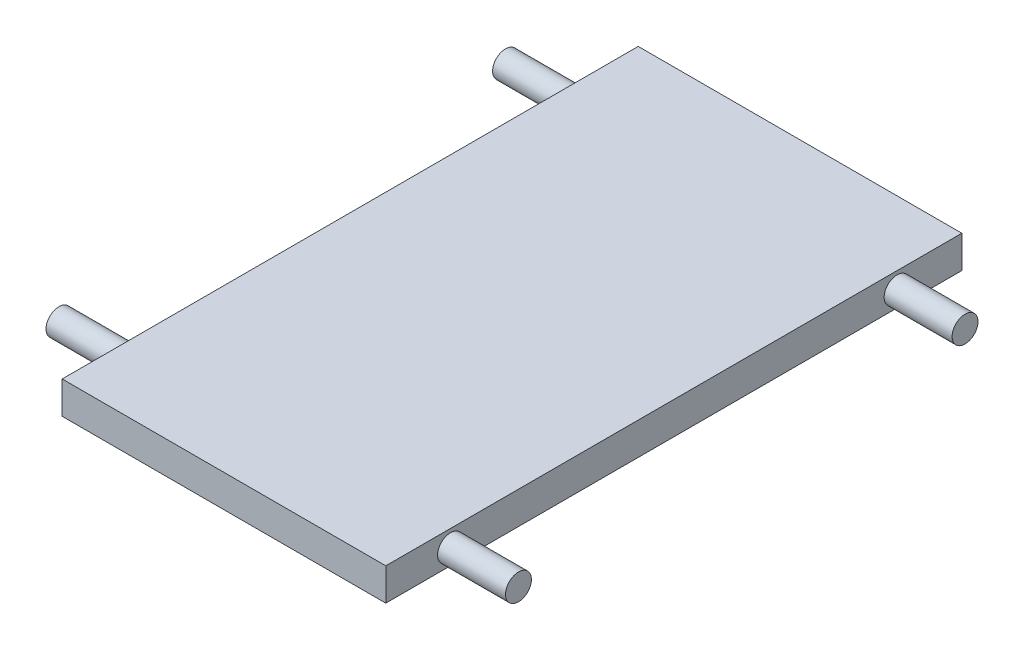
ISO-10303-21;
HEADER;
FILE_DESCRIPTION(('STEP AP214'),'2;1');
FILE_NAME('part.step','',(''),(''),'','','');
FILE_SCHEMA(('AUTOMOTIVE_DESIGN { 1 0 10303 214 1 1 1 1 }'));
ENDSEC;
DATA;
#1=APPLICATION_CONTEXT('core data for automotive mechanical design processes');
#2=APPLICATION_PROTOCOL_DEFINITION('international standard','automotive_design',2000,#1);
#3=PRODUCT_CONTEXT('',#1,'mechanical');
#4=PRODUCT('Part','Part','',(#3));
#5=PRODUCT_RELATED_PRODUCT_CATEGORY('part','',(#4));
#6=PRODUCT_DEFINITION_FORMATION('','',#4);
#7=PRODUCT_DEFINITION_CONTEXT('part definition',#1,'design');
#8=PRODUCT_DEFINITION('design','',#6,#7);
#9=PRODUCT_DEFINITION_SHAPE('','',#8);
#10=(LENGTH_UNIT() NAMED_UNIT(*) SI_UNIT(.MILLI.,.METRE.));
#11=(NAMED_UNIT(*) PLANE_ANGLE_UNIT() SI_UNIT($,.RADIAN.));
#12=(NAMED_UNIT(*) SI_UNIT($,.STERADIAN.) SOLID_ANGLE_UNIT());
#13=UNCERTAINTY_MEASURE_WITH_UNIT(LENGTH_MEASURE(1.E-05),#10,'distance_accuracy_value','');
#14=(GEOMETRIC_REPRESENTATION_CONTEXT(3) GLOBAL_UNCERTAINTY_ASSIGNED_CONTEXT((#13)) GLOBAL_UNIT_ASSIGNED_CONTEXT((#10,
#11,#12)) REPRESENTATION_CONTEXT('',''));
#15=CARTESIAN_POINT('',(0.,0.,0.));
#16=DIRECTION('',(0.,0.,1.));
#17=DIRECTION('',(1.,0.,0.));
#18=AXIS2_PLACEMENT_3D('',#15,#16,#17);
#19=CARTESIAN_POINT('',(250.,50.,445.));
#20=DIRECTION('',(-1.,0.,0.));
#21=DIRECTION('',(0.,0.,1.));
#22=AXIS2_PLACEMENT_3D('',#19,#20,#21);
#23=PLANE('',#22);
#24=CARTESIAN_POINT('',(250.,24.2743259743321,345.));
#25=DIRECTION('',(-1.,0.,0.));
#26=DIRECTION('',(0.,0.,1.));
#27=AXIS2_PLACEMENT_3D('',#24,#25,#26);
#28=CIRCLE('',#27,20.);
#29=CARTESIAN_POINT('',(250.,24.2743259743321,365.));
#30=VERTEX_POINT('',#29);
#31=EDGE_CURVE('E333',#30,#30,#28,.T.);
#32=ORIENTED_EDGE('',*,*,#31,.T.);
#33=EDGE_LOOP('',(#32));
#34=FACE_BOUND('',#33,.T.);
#35=CARTESIAN_POINT('',(250.,24.2743259743321,-345.));
#36=DIRECTION('',(-1.,0.,0.));
#37=DIRECTION('',(0.,0.,1.));
#38=AXIS2_PLACEMENT_3D('',#35,#36,#37);
#39=CIRCLE('',#38,20.);
#40=CARTESIAN_POINT('',(250.,24.2743259743321,-325.));
#41=VERTEX_POINT('',#40);
#42=EDGE_CURVE('E47',#41,#41,#39,.F.);
#43=ORIENTED_EDGE('',*,*,#42,.F.);
#44=EDGE_LOOP('',(#43));
#45=FACE_BOUND('',#44,.T.);
#46=DIRECTION('',(0.,0.,-1.));
#47=VECTOR('',#46,1.);
#48=CARTESIAN_POINT('',(250.,0.,445.));
#49=LINE('',#48,#47);
#50=CARTESIAN_POINT('',(250.,0.,445.));
#51=VERTEX_POINT('',#50);
#52=CARTESIAN_POINT('',(250.,0.,-445.));
#53=VERTEX_POINT('',#52);
#54=EDGE_CURVE('E125',#51,#53,#49,.T.);
#55=ORIENTED_EDGE('',*,*,#54,.T.);
#56=DIRECTION('',(0.,-1.,0.));
#57=VECTOR('',#56,1.);
#58=CARTESIAN_POINT('',(250.,50.,-445.));
#59=LINE('',#58,#57);
#60=CARTESIAN_POINT('',(250.,50.,-445.));
#61=VERTEX_POINT('',#60);
#62=EDGE_CURVE('E113',#61,#53,#59,.T.);
#63=ORIENTED_EDGE('',*,*,#62,.F.);
#64=DIRECTION('',(0.,0.,-1.));
#65=VECTOR('',#64,1.);
#66=CARTESIAN_POINT('',(250.,50.,445.));
#67=LINE('',#66,#65);
#68=CARTESIAN_POINT('',(250.,50.,445.));
#69=VERTEX_POINT('',#68);
#70=EDGE_CURVE('E105',#69,#61,#67,.T.);
#71=ORIENTED_EDGE('',*,*,#70,.F.);
#72=DIRECTION('',(0.,-1.,0.));
#73=VECTOR('',#72,1.);
#74=CARTESIAN_POINT('',(250.,50.,445.));
#75=LINE('',#74,#73);
#76=EDGE_CURVE('E121',#69,#51,#75,.T.);
#77=ORIENTED_EDGE('',*,*,#76,.T.);
#78=EDGE_LOOP('',(#55,#63,#71,#77));
#79=FACE_BOUND('',#78,.T.);
#80=ADVANCED_FACE('F38',(#34,#45,#79),#23,.F.);
#81=CARTESIAN_POINT('',(-250.,50.,-445.));
#82=DIRECTION('',(0.,0.,1.));
#83=DIRECTION('',(1.,0.,0.));
#84=AXIS2_PLACEMENT_3D('',#81,#82,#83);
#85=PLANE('',#84);
#86=DIRECTION('',(-1.,0.,0.));
#87=VECTOR('',#86,1.);
#88=CARTESIAN_POINT('',(-250.,0.,-445.));
#89=LINE('',#88,#87);
#90=CARTESIAN_POINT('',(-250.,0.,-445.));
#91=VERTEX_POINT('',#90);
#92=EDGE_CURVE('E111',#53,#91,#89,.T.);
#93=ORIENTED_EDGE('',*,*,#92,.T.);
#94=DIRECTION('',(0.,-1.,0.));
#95=VECTOR('',#94,1.);
#96=CARTESIAN_POINT('',(-250.,50.,-445.));
#97=LINE('',#96,#95);
#98=CARTESIAN_POINT('',(-250.,50.,-445.));
#99=VERTEX_POINT('',#98);
#100=EDGE_CURVE('E109',#99,#91,#97,.T.);
#101=ORIENTED_EDGE('',*,*,#100,.F.);
#102=DIRECTION('',(-1.,0.,0.));
#103=VECTOR('',#102,1.);
#104=CARTESIAN_POINT('',(-250.,50.,-445.));
#105=LINE('',#104,#103);
#106=EDGE_CURVE('E99',#61,#99,#105,.T.);
#107=ORIENTED_EDGE('',*,*,#106,.F.);
#108=ORIENTED_EDGE('',*,*,#62,.T.);
#109=EDGE_LOOP('',(#93,#101,#107,#108));
#110=FACE_BOUND('',#109,.T.);
#111=ADVANCED_FACE('F110',(#110),#85,.F.);
#112=CARTESIAN_POINT('',(-250.,50.,445.));
#113=DIRECTION('',(1.,0.,0.));
#114=DIRECTION('',(0.,0.,-1.));
#115=AXIS2_PLACEMENT_3D('',#112,#113,#114);
#116=PLANE('',#115);
#117=CARTESIAN_POINT('',(-250.,24.2743259743321,-345.));
#118=DIRECTION('',(1.,0.,0.));
#119=DIRECTION('',(0.,0.,-1.));
#120=AXIS2_PLACEMENT_3D('',#117,#118,#119);
#121=CIRCLE('',#120,20.);
#122=CARTESIAN_POINT('',(-250.,24.2743259743321,-365.));
#123=VERTEX_POINT('',#122);
#124=EDGE_CURVE('E328',#123,#123,#121,.T.);
#125=ORIENTED_EDGE('',*,*,#124,.T.);
#126=EDGE_LOOP('',(#125));
#127=FACE_BOUND('',#126,.T.);
#128=CARTESIAN_POINT('',(-250.,24.2743259743321,345.));
#129=DIRECTION('',(1.,0.,0.));
#130=DIRECTION('',(0.,0.,-1.));
#131=AXIS2_PLACEMENT_3D('',#128,#129,#130);
#132=CIRCLE('',#131,20.);
#133=CARTESIAN_POINT('',(-250.,24.2743259743321,325.));
#134=VERTEX_POINT('',#133);
#135=EDGE_CURVE('E11',#134,#134,#132,.F.);
#136=ORIENTED_EDGE('',*,*,#135,.F.);
#137=EDGE_LOOP('',(#136));
#138=FACE_BOUND('',#137,.T.);
#139=DIRECTION('',(0.,0.,1.));
#140=VECTOR('',#139,1.);
#141=CARTESIAN_POINT('',(-250.,0.,445.));
#142=LINE('',#141,#140);
#143=CARTESIAN_POINT('',(-250.,0.,445.));
#144=VERTEX_POINT('',#143);
#145=EDGE_CURVE('E81',#91,#144,#142,.T.);
#146=ORIENTED_EDGE('',*,*,#145,.T.);
#147=DIRECTION('',(0.,-1.,0.));
#148=VECTOR('',#147,1.);
#149=CARTESIAN_POINT('',(-250.,50.,445.));
#150=LINE('',#149,#148);
#151=CARTESIAN_POINT('',(-250.,50.,445.));
#152=VERTEX_POINT('',#151);
#153=EDGE_CURVE('E114',#152,#144,#150,.T.);
#154=ORIENTED_EDGE('',*,*,#153,.F.);
#155=DIRECTION('',(0.,0.,1.));
#156=VECTOR('',#155,1.);
#157=CARTESIAN_POINT('',(-250.,50.,445.));
#158=LINE('',#157,#156);
#159=EDGE_CURVE('E103',#99,#152,#158,.T.);
#160=ORIENTED_EDGE('',*,*,#159,.F.);
#161=ORIENTED_EDGE('',*,*,#100,.T.);
#162=EDGE_LOOP('',(#146,#154,#160,#161));
#163=FACE_BOUND('',#162,.T.);
#164=ADVANCED_FACE('F116',(#127,#138,#163),#116,.F.);
#165=CARTESIAN_POINT('',(-250.,50.,445.));
#166=DIRECTION('',(0.,0.,-1.));
#167=DIRECTION('',(-1.,0.,0.));
#168=AXIS2_PLACEMENT_3D('',#165,#166,#167);
#169=PLANE('',#168);
#170=DIRECTION('',(1.,0.,0.));
#171=VECTOR('',#170,1.);
#172=CARTESIAN_POINT('',(-250.,0.,445.));
#173=LINE('',#172,#171);
#174=EDGE_CURVE('E89',#144,#51,#173,.T.);
#175=ORIENTED_EDGE('',*,*,#174,.T.);
#176=ORIENTED_EDGE('',*,*,#76,.F.);
#177=DIRECTION('',(1.,0.,0.));
#178=VECTOR('',#177,1.);
#179=CARTESIAN_POINT('',(-250.,50.,445.));
#180=LINE('',#179,#178);
#181=EDGE_CURVE('E59',#152,#69,#180,.T.);
#182=ORIENTED_EDGE('',*,*,#181,.F.);
#183=ORIENTED_EDGE('',*,*,#153,.T.);
#184=EDGE_LOOP('',(#175,#176,#182,#183));
#185=FACE_BOUND('',#184,.T.);
#186=ADVANCED_FACE('F163',(#185),#169,.F.);
#187=CARTESIAN_POINT('',(0.,50.,0.));
#188=DIRECTION('',(0.,-1.,0.));
#189=DIRECTION('',(0.,0.,-1.));
#190=AXIS2_PLACEMENT_3D('',#187,#188,#189);
#191=PLANE('',#190);
#192=ORIENTED_EDGE('',*,*,#70,.T.);
#193=ORIENTED_EDGE('',*,*,#106,.T.);
#194=ORIENTED_EDGE('',*,*,#159,.T.);
#195=ORIENTED_EDGE('',*,*,#181,.T.);
#196=EDGE_LOOP('',(#192,#193,#194,#195));
#197=FACE_BOUND('',#196,.T.);
#198=ADVANCED_FACE('F101',(#197),#191,.F.);
#199=CARTESIAN_POINT('',(0.,0.,0.));
#200=DIRECTION('',(0.,-1.,0.));
#201=DIRECTION('',(0.,0.,-1.));
#202=AXIS2_PLACEMENT_3D('',#199,#200,#201);
#203=PLANE('',#202);
#204=ORIENTED_EDGE('',*,*,#54,.F.);
#205=ORIENTED_EDGE('',*,*,#174,.F.);
#206=ORIENTED_EDGE('',*,*,#145,.F.);
#207=ORIENTED_EDGE('',*,*,#92,.F.);
#208=EDGE_LOOP('',(#204,#205,#206,#207));
#209=FACE_BOUND('',#208,.T.);
#210=ADVANCED_FACE('F153',(#209),#203,.T.);
#211=CARTESIAN_POINT('',(355.,24.2743259743321,-345.));
#212=DIRECTION('',(-1.,0.,0.));
#213=DIRECTION('',(0.,0.,1.));
#214=AXIS2_PLACEMENT_3D('',#211,#212,#213);
#215=CYLINDRICAL_SURFACE('',#214,20.);
#216=CARTESIAN_POINT('',(355.,24.2743259743321,-345.));
#217=DIRECTION('',(1.,0.,0.));
#218=DIRECTION('',(0.,0.,-1.));
#219=AXIS2_PLACEMENT_3D('',#216,#217,#218);
#220=CIRCLE('',#219,20.);
#221=CARTESIAN_POINT('',(355.,24.2743259743321,-365.));
#222=VERTEX_POINT('',#221);
#223=EDGE_CURVE('E129',#222,#222,#220,.T.);
#224=ORIENTED_EDGE('',*,*,#223,.F.);
#225=EDGE_LOOP('',(#224));
#226=FACE_BOUND('',#225,.T.);
#227=ORIENTED_EDGE('',*,*,#42,.T.);
#228=EDGE_LOOP('',(#227));
#229=FACE_BOUND('',#228,.T.);
#230=ADVANCED_FACE('F146',(#226,#229),#215,.T.);
#231=CARTESIAN_POINT('',(355.,24.2743259743321,-345.));
#232=DIRECTION('',(1.,0.,0.));
#233=DIRECTION('',(0.,0.,-1.));
#234=AXIS2_PLACEMENT_3D('',#231,#232,#233);
#235=PLANE('',#234);
#236=ORIENTED_EDGE('',*,*,#223,.T.);
#237=EDGE_LOOP('',(#236));
#238=FACE_BOUND('',#237,.T.);
#239=ADVANCED_FACE('F160',(#238),#235,.T.);
#240=CARTESIAN_POINT('',(355.,24.2743259743321,345.));
#241=DIRECTION('',(-1.,0.,0.));
#242=DIRECTION('',(0.,0.,1.));
#243=AXIS2_PLACEMENT_3D('',#240,#241,#242);
#244=CYLINDRICAL_SURFACE('',#243,20.);
#245=CARTESIAN_POINT('',(355.,24.2743259743321,345.));
#246=DIRECTION('',(-1.,0.,0.));
#247=DIRECTION('',(0.,0.,1.));
#248=AXIS2_PLACEMENT_3D('',#245,#246,#247);
#249=CIRCLE('',#248,20.);
#250=CARTESIAN_POINT('',(355.,24.2743259743321,365.));
#251=VERTEX_POINT('',#250);
#252=EDGE_CURVE('E338',#251,#251,#249,.T.);
#253=ORIENTED_EDGE('',*,*,#252,.T.);
#254=EDGE_LOOP('',(#253));
#255=FACE_BOUND('',#254,.T.);
#256=ORIENTED_EDGE('',*,*,#31,.F.);
#257=EDGE_LOOP('',(#256));
#258=FACE_BOUND('',#257,.T.);
#259=ADVANCED_FACE('F206',(#255,#258),#244,.T.);
#260=CARTESIAN_POINT('',(355.,24.2743259743321,345.));
#261=DIRECTION('',(1.,0.,0.));
#262=DIRECTION('',(0.,0.,1.));
#263=AXIS2_PLACEMENT_3D('',#260,#261,#262);
#264=PLANE('',#263);
#265=ORIENTED_EDGE('',*,*,#252,.F.);
#266=EDGE_LOOP('',(#265));
#267=FACE_BOUND('',#266,.T.);
#268=ADVANCED_FACE('F217',(#267),#264,.T.);
#269=CARTESIAN_POINT('',(-355.,24.2743259743321,345.));
#270=DIRECTION('',(1.,0.,0.));
#271=DIRECTION('',(0.,0.,-1.));
#272=AXIS2_PLACEMENT_3D('',#269,#270,#271);
#273=CYLINDRICAL_SURFACE('',#272,20.);
#274=CARTESIAN_POINT('',(-355.,24.2743259743321,345.));
#275=DIRECTION('',(-1.,0.,0.));
#276=DIRECTION('',(0.,0.,1.));
#277=AXIS2_PLACEMENT_3D('',#274,#275,#276);
#278=CIRCLE('',#277,20.);
#279=CARTESIAN_POINT('',(-355.,24.2743259743321,365.));
#280=VERTEX_POINT('',#279);
#281=EDGE_CURVE('E327',#280,#280,#278,.T.);
#282=ORIENTED_EDGE('',*,*,#281,.F.);
#283=EDGE_LOOP('',(#282));
#284=FACE_BOUND('',#283,.T.);
#285=ORIENTED_EDGE('',*,*,#135,.T.);
#286=EDGE_LOOP('',(#285));
#287=FACE_BOUND('',#286,.T.);
#288=ADVANCED_FACE('F227',(#284,#287),#273,.T.);
#289=CARTESIAN_POINT('',(-355.,24.2743259743321,345.));
#290=DIRECTION('',(-1.,0.,0.));
#291=DIRECTION('',(0.,0.,1.));
#292=AXIS2_PLACEMENT_3D('',#289,#290,#291);
#293=PLANE('',#292);
#294=ORIENTED_EDGE('',*,*,#281,.T.);
#295=EDGE_LOOP('',(#294));
#296=FACE_BOUND('',#295,.T.);
#297=ADVANCED_FACE('F237',(#296),#293,.T.);
#298=CARTESIAN_POINT('',(-355.,24.2743259743321,-345.));
#299=DIRECTION('',(1.,0.,0.));
#300=DIRECTION('',(0.,0.,-1.));
#301=AXIS2_PLACEMENT_3D('',#298,#299,#300);
#302=CYLINDRICAL_SURFACE('',#301,20.);
#303=CARTESIAN_POINT('',(-355.,24.2743259743321,-345.));
#304=DIRECTION('',(1.,0.,0.));
#305=DIRECTION('',(0.,0.,-1.));
#306=AXIS2_PLACEMENT_3D('',#303,#304,#305);
#307=CIRCLE('',#306,20.);
#308=CARTESIAN_POINT('',(-355.,24.2743259743321,-365.));
#309=VERTEX_POINT('',#308);
#310=EDGE_CURVE('E325',#309,#309,#307,.T.);
#311=ORIENTED_EDGE('',*,*,#310,.T.);
#312=EDGE_LOOP('',(#311));
#313=FACE_BOUND('',#312,.T.);
#314=ORIENTED_EDGE('',*,*,#124,.F.);
#315=EDGE_LOOP('',(#314));
#316=FACE_BOUND('',#315,.T.);
#317=ADVANCED_FACE('F247',(#313,#316),#302,.T.);
#318=CARTESIAN_POINT('',(-355.,24.2743259743321,-345.));
#319=DIRECTION('',(-1.,0.,0.));
#320=DIRECTION('',(0.,0.,-1.));
#321=AXIS2_PLACEMENT_3D('',#318,#319,#320);
#322=PLANE('',#321);
#323=ORIENTED_EDGE('',*,*,#310,.F.);
#324=EDGE_LOOP('',(#323));
#325=FACE_BOUND('',#324,.T.);
#326=ADVANCED_FACE('F257',(#325),#322,.T.);
#327=CLOSED_SHELL('',(#80,#111,#164,#186,#198,#210,#230,#239,#259,#268,#288,#297,#317,#326));
#328=MANIFOLD_SOLID_BREP('B2',#327);
#329=ADVANCED_BREP_SHAPE_REPRESENTATION('',(#18,#328),#14);
#330=SHAPE_DEFINITION_REPRESENTATION(#9,#329);
ENDSEC;
END-ISO-10303-21;
